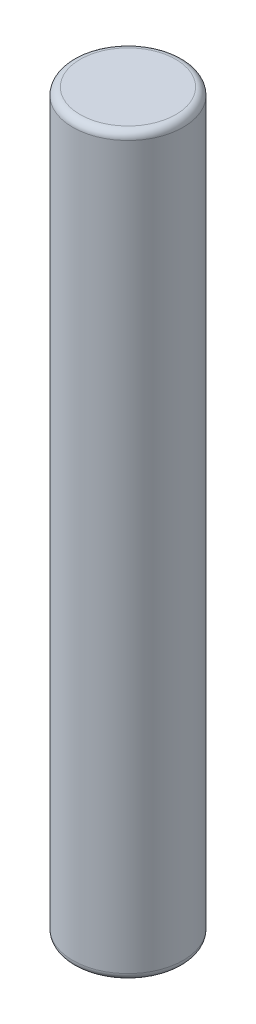
ISO-10303-21;
HEADER;
FILE_DESCRIPTION(('STEP AP214'),'2;1');
FILE_NAME('part.step','',(''),(''),'','','');
FILE_SCHEMA(('AUTOMOTIVE_DESIGN { 1 0 10303 214 1 1 1 1 }'));
ENDSEC;
DATA;
#1=APPLICATION_CONTEXT('core data for automotive mechanical design processes');
#2=APPLICATION_PROTOCOL_DEFINITION('international standard','automotive_design',2000,#1);
#3=PRODUCT_CONTEXT('',#1,'mechanical');
#4=PRODUCT('Part','Part','',(#3));
#5=PRODUCT_RELATED_PRODUCT_CATEGORY('part','',(#4));
#6=PRODUCT_DEFINITION_FORMATION('','',#4);
#7=PRODUCT_DEFINITION_CONTEXT('part definition',#1,'design');
#8=PRODUCT_DEFINITION('design','',#6,#7);
#9=PRODUCT_DEFINITION_SHAPE('','',#8);
#10=(LENGTH_UNIT() NAMED_UNIT(*) SI_UNIT(.MILLI.,.METRE.));
#11=(NAMED_UNIT(*) PLANE_ANGLE_UNIT() SI_UNIT($,.RADIAN.));
#12=(NAMED_UNIT(*) SI_UNIT($,.STERADIAN.) SOLID_ANGLE_UNIT());
#13=UNCERTAINTY_MEASURE_WITH_UNIT(LENGTH_MEASURE(1.E-05),#10,'distance_accuracy_value','');
#14=(GEOMETRIC_REPRESENTATION_CONTEXT(3) GLOBAL_UNCERTAINTY_ASSIGNED_CONTEXT((#13)) GLOBAL_UNIT_ASSIGNED_CONTEXT((#10,
#11,#12)) REPRESENTATION_CONTEXT('',''));
#15=CARTESIAN_POINT('',(0.,0.,0.));
#16=DIRECTION('',(0.,0.,1.));
#17=DIRECTION('',(1.,0.,0.));
#18=AXIS2_PLACEMENT_3D('',#15,#16,#17);
#19=CARTESIAN_POINT('',(0.,20.,0.));
#20=DIRECTION('',(0.,-1.,0.));
#21=DIRECTION('',(0.,0.,-1.));
#22=AXIS2_PLACEMENT_3D('',#19,#20,#21);
#23=CYLINDRICAL_SURFACE('',#22,1.5);
#24=CARTESIAN_POINT('',(0.,0.2,0.));
#25=DIRECTION('',(0.,1.,0.));
#26=DIRECTION('',(0.,0.,1.));
#27=AXIS2_PLACEMENT_3D('',#24,#25,#26);
#28=CIRCLE('',#27,1.5);
#29=CARTESIAN_POINT('',(0.,0.2,1.5));
#30=VERTEX_POINT('',#29);
#31=EDGE_CURVE('E25',#30,#30,#28,.T.);
#32=ORIENTED_EDGE('',*,*,#31,.T.);
#33=EDGE_LOOP('',(#32));
#34=FACE_BOUND('',#33,.T.);
#35=CARTESIAN_POINT('',(0.,19.8,0.));
#36=DIRECTION('',(0.,1.,0.));
#37=DIRECTION('',(0.,0.,1.));
#38=AXIS2_PLACEMENT_3D('',#35,#36,#37);
#39=CIRCLE('',#38,1.5);
#40=CARTESIAN_POINT('',(0.,19.8,1.5));
#41=VERTEX_POINT('',#40);
#42=EDGE_CURVE('E29',#41,#41,#39,.F.);
#43=ORIENTED_EDGE('',*,*,#42,.T.);
#44=EDGE_LOOP('',(#43));
#45=FACE_BOUND('',#44,.T.);
#46=ADVANCED_FACE('F14',(#34,#45),#23,.T.);
#47=CARTESIAN_POINT('',(0.,20.,0.));
#48=DIRECTION('',(0.,1.,0.));
#49=DIRECTION('',(0.,0.,1.));
#50=AXIS2_PLACEMENT_3D('',#47,#48,#49);
#51=PLANE('',#50);
#52=CARTESIAN_POINT('',(0.,20.,0.));
#53=DIRECTION('',(0.,1.,0.));
#54=DIRECTION('',(0.,0.,1.));
#55=AXIS2_PLACEMENT_3D('',#52,#53,#54);
#56=CIRCLE('',#55,1.3);
#57=CARTESIAN_POINT('',(0.,20.,1.3));
#58=VERTEX_POINT('',#57);
#59=EDGE_CURVE('E10',#58,#58,#56,.T.);
#60=ORIENTED_EDGE('',*,*,#59,.T.);
#61=EDGE_LOOP('',(#60));
#62=FACE_BOUND('',#61,.T.);
#63=ADVANCED_FACE('F47',(#62),#51,.T.);
#64=CARTESIAN_POINT('',(0.,0.,0.));
#65=DIRECTION('',(0.,1.,0.));
#66=DIRECTION('',(0.,0.,1.));
#67=AXIS2_PLACEMENT_3D('',#64,#65,#66);
#68=PLANE('',#67);
#69=CARTESIAN_POINT('',(0.,0.,0.));
#70=DIRECTION('',(0.,1.,0.));
#71=DIRECTION('',(0.,0.,1.));
#72=AXIS2_PLACEMENT_3D('',#69,#70,#71);
#73=CIRCLE('',#72,1.3);
#74=CARTESIAN_POINT('',(0.,0.,1.3));
#75=VERTEX_POINT('',#74);
#76=EDGE_CURVE('E21',#75,#75,#73,.F.);
#77=ORIENTED_EDGE('',*,*,#76,.T.);
#78=EDGE_LOOP('',(#77));
#79=FACE_BOUND('',#78,.T.);
#80=ADVANCED_FACE('F44',(#79),#68,.F.);
#81=CARTESIAN_POINT('',(0.,0.2,0.));
#82=DIRECTION('',(0.,1.,0.));
#83=DIRECTION('',(0.,0.,1.));
#84=AXIS2_PLACEMENT_3D('',#81,#82,#83);
#85=TOROIDAL_SURFACE('',#84,1.3,0.2);
#86=ORIENTED_EDGE('',*,*,#76,.F.);
#87=EDGE_LOOP('',(#86));
#88=FACE_BOUND('',#87,.T.);
#89=ORIENTED_EDGE('',*,*,#31,.F.);
#90=EDGE_LOOP('',(#89));
#91=FACE_BOUND('',#90,.T.);
#92=ADVANCED_FACE('F38',(#88,#91),#85,.T.);
#93=CARTESIAN_POINT('',(0.,19.8,0.));
#94=DIRECTION('',(0.,1.,0.));
#95=DIRECTION('',(0.,0.,1.));
#96=AXIS2_PLACEMENT_3D('',#93,#94,#95);
#97=TOROIDAL_SURFACE('',#96,1.3,0.2);
#98=ORIENTED_EDGE('',*,*,#42,.F.);
#99=EDGE_LOOP('',(#98));
#100=FACE_BOUND('',#99,.T.);
#101=ORIENTED_EDGE('',*,*,#59,.F.);
#102=EDGE_LOOP('',(#101));
#103=FACE_BOUND('',#102,.T.);
#104=ADVANCED_FACE('F16',(#100,#103),#97,.T.);
#105=CLOSED_SHELL('',(#46,#63,#80,#92,#104));
#106=MANIFOLD_SOLID_BREP('B1',#105);
#107=ADVANCED_BREP_SHAPE_REPRESENTATION('',(#18,#106),#14);
#108=SHAPE_DEFINITION_REPRESENTATION(#9,#107);
ENDSEC;
END-ISO-10303-21;
